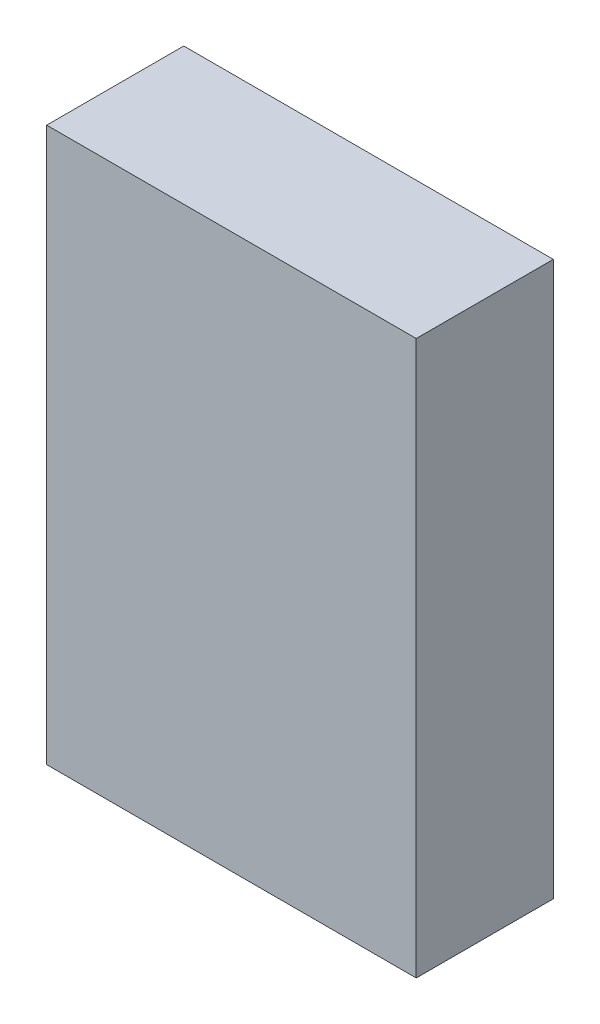
ISO-10303-21;
HEADER;
FILE_DESCRIPTION(('STEP AP214'),'2;1');
FILE_NAME('part.step','',(''),(''),'','','');
FILE_SCHEMA(('AUTOMOTIVE_DESIGN { 1 0 10303 214 1 1 1 1 }'));
ENDSEC;
DATA;
#1=APPLICATION_CONTEXT('core data for automotive mechanical design processes');
#2=APPLICATION_PROTOCOL_DEFINITION('international standard','automotive_design',2000,#1);
#3=PRODUCT_CONTEXT('',#1,'mechanical');
#4=PRODUCT('Part','Part','',(#3));
#5=PRODUCT_RELATED_PRODUCT_CATEGORY('part','',(#4));
#6=PRODUCT_DEFINITION_FORMATION('','',#4);
#7=PRODUCT_DEFINITION_CONTEXT('part definition',#1,'design');
#8=PRODUCT_DEFINITION('design','',#6,#7);
#9=PRODUCT_DEFINITION_SHAPE('','',#8);
#10=(LENGTH_UNIT() NAMED_UNIT(*) SI_UNIT(.MILLI.,.METRE.));
#11=(NAMED_UNIT(*) PLANE_ANGLE_UNIT() SI_UNIT($,.RADIAN.));
#12=(NAMED_UNIT(*) SI_UNIT($,.STERADIAN.) SOLID_ANGLE_UNIT());
#13=UNCERTAINTY_MEASURE_WITH_UNIT(LENGTH_MEASURE(1.E-05),#10,'distance_accuracy_value','');
#14=(GEOMETRIC_REPRESENTATION_CONTEXT(3) GLOBAL_UNCERTAINTY_ASSIGNED_CONTEXT((#13)) GLOBAL_UNIT_ASSIGNED_CONTEXT((#10,
#11,#12)) REPRESENTATION_CONTEXT('',''));
#15=CARTESIAN_POINT('',(0.,0.,0.));
#16=DIRECTION('',(0.,0.,1.));
#17=DIRECTION('',(1.,0.,0.));
#18=AXIS2_PLACEMENT_3D('',#15,#16,#17);
#19=CARTESIAN_POINT('',(1.99499982,-2.9899991,1.48));
#20=DIRECTION('',(0.,0.,-1.));
#21=DIRECTION('',(-1.,0.,0.));
#22=AXIS2_PLACEMENT_3D('',#19,#20,#21);
#23=PLANE('',#22);
#24=DIRECTION('',(1.,0.,0.));
#25=VECTOR('',#24,1.);
#26=CARTESIAN_POINT('',(1.99499982,2.9899991,1.48));
#27=LINE('',#26,#25);
#28=CARTESIAN_POINT('',(1.99499982,2.9899991,1.48));
#29=VERTEX_POINT('',#28);
#30=CARTESIAN_POINT('',(-1.99499982,2.9899991,1.48));
#31=VERTEX_POINT('',#30);
#32=EDGE_CURVE('E54',#29,#31,#27,.F.);
#33=ORIENTED_EDGE('',*,*,#32,.T.);
#34=DIRECTION('',(0.,1.,0.));
#35=VECTOR('',#34,1.);
#36=CARTESIAN_POINT('',(-1.99499982,2.9899991,1.48));
#37=LINE('',#36,#35);
#38=CARTESIAN_POINT('',(-1.99499982,-2.9899991,1.48));
#39=VERTEX_POINT('',#38);
#40=EDGE_CURVE('E56',#31,#39,#37,.F.);
#41=ORIENTED_EDGE('',*,*,#40,.T.);
#42=DIRECTION('',(1.,0.,0.));
#43=VECTOR('',#42,1.);
#44=CARTESIAN_POINT('',(-1.99499982,-2.9899991,1.48));
#45=LINE('',#44,#43);
#46=CARTESIAN_POINT('',(1.99499982,-2.9899991,1.48));
#47=VERTEX_POINT('',#46);
#48=EDGE_CURVE('E19',#39,#47,#45,.T.);
#49=ORIENTED_EDGE('',*,*,#48,.T.);
#50=DIRECTION('',(0.,1.,0.));
#51=VECTOR('',#50,1.);
#52=CARTESIAN_POINT('',(1.99499982,-2.9899991,1.48));
#53=LINE('',#52,#51);
#54=EDGE_CURVE('E79',#47,#29,#53,.T.);
#55=ORIENTED_EDGE('',*,*,#54,.T.);
#56=EDGE_LOOP('',(#33,#41,#49,#55));
#57=FACE_BOUND('',#56,.T.);
#58=ADVANCED_FACE('F16',(#57),#23,.F.);
#59=CARTESIAN_POINT('',(-1.99499982,-2.9899991,0.));
#60=DIRECTION('',(0.,1.,0.));
#61=DIRECTION('',(0.,0.,1.));
#62=AXIS2_PLACEMENT_3D('',#59,#60,#61);
#63=PLANE('',#62);
#64=DIRECTION('',(0.,0.,1.));
#65=VECTOR('',#64,1.);
#66=CARTESIAN_POINT('',(1.99499982,-2.9899991,0.));
#67=LINE('',#66,#65);
#68=CARTESIAN_POINT('',(1.99499982,-2.9899991,0.));
#69=VERTEX_POINT('',#68);
#70=EDGE_CURVE('E67',#69,#47,#67,.T.);
#71=ORIENTED_EDGE('',*,*,#70,.T.);
#72=ORIENTED_EDGE('',*,*,#48,.F.);
#73=DIRECTION('',(0.,0.,-1.));
#74=VECTOR('',#73,1.);
#75=CARTESIAN_POINT('',(-1.99499982,-2.9899991,0.));
#76=LINE('',#75,#74);
#77=CARTESIAN_POINT('',(-1.99499982,-2.9899991,0.));
#78=VERTEX_POINT('',#77);
#79=EDGE_CURVE('E62',#39,#78,#76,.T.);
#80=ORIENTED_EDGE('',*,*,#79,.T.);
#81=DIRECTION('',(-1.,0.,0.));
#82=VECTOR('',#81,1.);
#83=CARTESIAN_POINT('',(1.99499982,-2.9899991,0.));
#84=LINE('',#83,#82);
#85=EDGE_CURVE('E82',#69,#78,#84,.T.);
#86=ORIENTED_EDGE('',*,*,#85,.F.);
#87=EDGE_LOOP('',(#71,#72,#80,#86));
#88=FACE_BOUND('',#87,.T.);
#89=ADVANCED_FACE('F64',(#88),#63,.F.);
#90=CARTESIAN_POINT('',(-1.99499982,2.9899991,0.));
#91=DIRECTION('',(1.,0.,0.));
#92=DIRECTION('',(0.,0.,-1.));
#93=AXIS2_PLACEMENT_3D('',#90,#91,#92);
#94=PLANE('',#93);
#95=ORIENTED_EDGE('',*,*,#79,.F.);
#96=ORIENTED_EDGE('',*,*,#40,.F.);
#97=DIRECTION('',(0.,0.,-1.));
#98=VECTOR('',#97,1.);
#99=CARTESIAN_POINT('',(-1.99499982,2.9899991,0.));
#100=LINE('',#99,#98);
#101=CARTESIAN_POINT('',(-1.99499982,2.9899991,0.));
#102=VERTEX_POINT('',#101);
#103=EDGE_CURVE('E74',#31,#102,#100,.T.);
#104=ORIENTED_EDGE('',*,*,#103,.T.);
#105=DIRECTION('',(0.,1.,0.));
#106=VECTOR('',#105,1.);
#107=CARTESIAN_POINT('',(-1.99499982,-2.9899991,0.));
#108=LINE('',#107,#106);
#109=EDGE_CURVE('E71',#78,#102,#108,.T.);
#110=ORIENTED_EDGE('',*,*,#109,.F.);
#111=EDGE_LOOP('',(#95,#96,#104,#110));
#112=FACE_BOUND('',#111,.T.);
#113=ADVANCED_FACE('F69',(#112),#94,.F.);
#114=CARTESIAN_POINT('',(1.99499982,2.9899991,0.));
#115=DIRECTION('',(0.,-1.,0.));
#116=DIRECTION('',(0.,0.,-1.));
#117=AXIS2_PLACEMENT_3D('',#114,#115,#116);
#118=PLANE('',#117);
#119=ORIENTED_EDGE('',*,*,#103,.F.);
#120=ORIENTED_EDGE('',*,*,#32,.F.);
#121=DIRECTION('',(0.,0.,1.));
#122=VECTOR('',#121,1.);
#123=CARTESIAN_POINT('',(1.99499982,2.9899991,0.));
#124=LINE('',#123,#122);
#125=CARTESIAN_POINT('',(1.99499982,2.9899991,0.));
#126=VERTEX_POINT('',#125);
#127=EDGE_CURVE('E34',#29,#126,#124,.F.);
#128=ORIENTED_EDGE('',*,*,#127,.T.);
#129=DIRECTION('',(-1.,0.,0.));
#130=VECTOR('',#129,1.);
#131=CARTESIAN_POINT('',(1.99499982,2.9899991,0.));
#132=LINE('',#131,#130);
#133=EDGE_CURVE('E25',#102,#126,#132,.F.);
#134=ORIENTED_EDGE('',*,*,#133,.F.);
#135=EDGE_LOOP('',(#119,#120,#128,#134));
#136=FACE_BOUND('',#135,.T.);
#137=ADVANCED_FACE('F88',(#136),#118,.F.);
#138=CARTESIAN_POINT('',(1.99499982,-2.9899991,0.));
#139=DIRECTION('',(-1.,0.,0.));
#140=DIRECTION('',(0.,0.,1.));
#141=AXIS2_PLACEMENT_3D('',#138,#139,#140);
#142=PLANE('',#141);
#143=ORIENTED_EDGE('',*,*,#127,.F.);
#144=ORIENTED_EDGE('',*,*,#54,.F.);
#145=ORIENTED_EDGE('',*,*,#70,.F.);
#146=DIRECTION('',(0.,1.,0.));
#147=VECTOR('',#146,1.);
#148=CARTESIAN_POINT('',(1.99499982,-2.9899991,0.));
#149=LINE('',#148,#147);
#150=EDGE_CURVE('E11',#126,#69,#149,.F.);
#151=ORIENTED_EDGE('',*,*,#150,.F.);
#152=EDGE_LOOP('',(#143,#144,#145,#151));
#153=FACE_BOUND('',#152,.T.);
#154=ADVANCED_FACE('F90',(#153),#142,.F.);
#155=CARTESIAN_POINT('',(1.99499982,-2.9899991,0.));
#156=DIRECTION('',(0.,0.,-1.));
#157=DIRECTION('',(-1.,0.,0.));
#158=AXIS2_PLACEMENT_3D('',#155,#156,#157);
#159=PLANE('',#158);
#160=ORIENTED_EDGE('',*,*,#133,.T.);
#161=ORIENTED_EDGE('',*,*,#150,.T.);
#162=ORIENTED_EDGE('',*,*,#85,.T.);
#163=ORIENTED_EDGE('',*,*,#109,.T.);
#164=EDGE_LOOP('',(#160,#161,#162,#163));
#165=FACE_BOUND('',#164,.T.);
#166=ADVANCED_FACE('F87',(#165),#159,.T.);
#167=CLOSED_SHELL('',(#58,#89,#113,#137,#154,#166));
#168=MANIFOLD_SOLID_BREP('B1',#167);
#169=ADVANCED_BREP_SHAPE_REPRESENTATION('',(#18,#168),#14);
#170=SHAPE_DEFINITION_REPRESENTATION(#9,#169);
ENDSEC;
END-ISO-10303-21;
